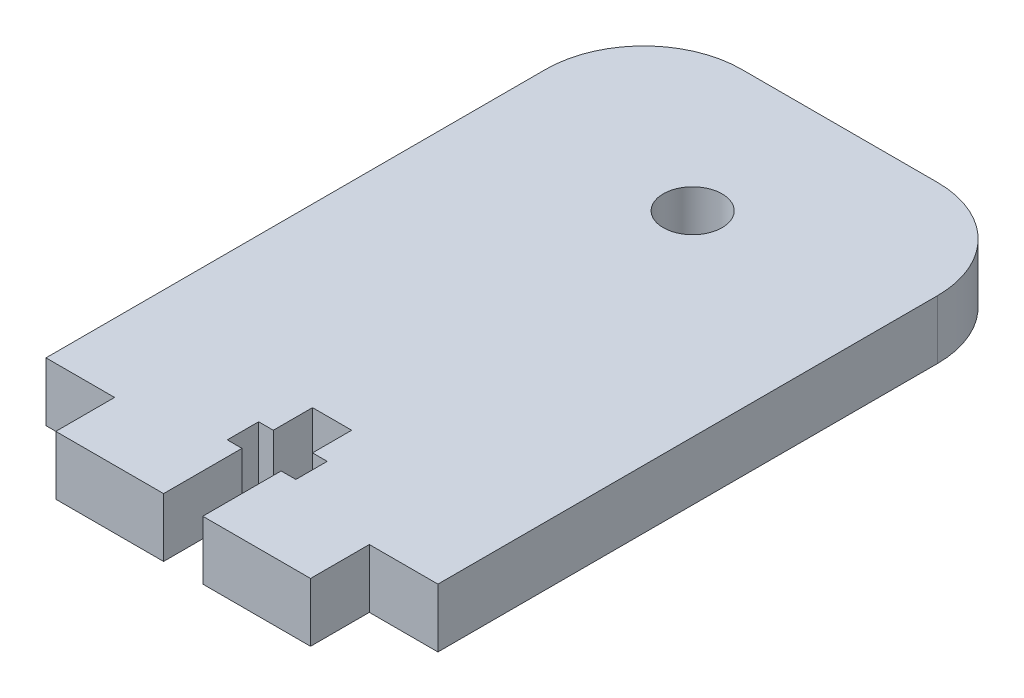
ISO-10303-21;
HEADER;
FILE_DESCRIPTION(('STEP AP214'),'2;1');
FILE_NAME('part.step','',(''),(''),'','','');
FILE_SCHEMA(('AUTOMOTIVE_DESIGN { 1 0 10303 214 1 1 1 1 }'));
ENDSEC;
DATA;
#1=APPLICATION_CONTEXT('core data for automotive mechanical design processes');
#2=APPLICATION_PROTOCOL_DEFINITION('international standard','automotive_design',2000,#1);
#3=PRODUCT_CONTEXT('',#1,'mechanical');
#4=PRODUCT('Part','Part','',(#3));
#5=PRODUCT_RELATED_PRODUCT_CATEGORY('part','',(#4));
#6=PRODUCT_DEFINITION_FORMATION('','',#4);
#7=PRODUCT_DEFINITION_CONTEXT('part definition',#1,'design');
#8=PRODUCT_DEFINITION('design','',#6,#7);
#9=PRODUCT_DEFINITION_SHAPE('','',#8);
#10=(LENGTH_UNIT() NAMED_UNIT(*) SI_UNIT(.MILLI.,.METRE.));
#11=(NAMED_UNIT(*) PLANE_ANGLE_UNIT() SI_UNIT($,.RADIAN.));
#12=(NAMED_UNIT(*) SI_UNIT($,.STERADIAN.) SOLID_ANGLE_UNIT());
#13=UNCERTAINTY_MEASURE_WITH_UNIT(LENGTH_MEASURE(1.E-05),#10,'distance_accuracy_value','');
#14=(GEOMETRIC_REPRESENTATION_CONTEXT(3) GLOBAL_UNCERTAINTY_ASSIGNED_CONTEXT((#13)) GLOBAL_UNIT_ASSIGNED_CONTEXT((#10,
#11,#12)) REPRESENTATION_CONTEXT('',''));
#15=CARTESIAN_POINT('',(0.,0.,0.));
#16=DIRECTION('',(0.,0.,1.));
#17=DIRECTION('',(1.,0.,0.));
#18=AXIS2_PLACEMENT_3D('',#15,#16,#17);
#19=CARTESIAN_POINT('',(10.2382336935266,6.,-24.4529347741064));
#20=DIRECTION('',(0.,-1.,0.));
#21=DIRECTION('',(0.,0.,-1.));
#22=AXIS2_PLACEMENT_3D('',#19,#20,#21);
#23=PLANE('',#22);
#24=DIRECTION('',(1.,0.,0.));
#25=VECTOR('',#24,1.);
#26=CARTESIAN_POINT('',(-3.2617663064734,6.,21.3470652258936));
#27=LINE('',#26,#25);
#28=CARTESIAN_POINT('',(-3.2617663064734,6.,21.3470652258936));
#29=VERTEX_POINT('',#28);
#30=CARTESIAN_POINT('',(-1.7617663064734,6.,21.3470652258936));
#31=VERTEX_POINT('',#30);
#32=EDGE_CURVE('E293',#29,#31,#27,.T.);
#33=ORIENTED_EDGE('',*,*,#32,.T.);
#34=DIRECTION('',(0.,0.,-1.));
#35=VECTOR('',#34,1.);
#36=CARTESIAN_POINT('',(-1.7617663064734,6.,21.3470652258936));
#37=LINE('',#36,#35);
#38=CARTESIAN_POINT('',(-1.7617663064734,6.,17.3470652258936));
#39=VERTEX_POINT('',#38);
#40=EDGE_CURVE('E145',#31,#39,#37,.T.);
#41=ORIENTED_EDGE('',*,*,#40,.T.);
#42=DIRECTION('',(1.,0.,0.));
#43=VECTOR('',#42,1.);
#44=CARTESIAN_POINT('',(-1.7617663064734,6.,17.3470652258936));
#45=LINE('',#44,#43);
#46=CARTESIAN_POINT('',(2.2382336935266,6.,17.3470652258936));
#47=VERTEX_POINT('',#46);
#48=EDGE_CURVE('E370',#39,#47,#45,.T.);
#49=ORIENTED_EDGE('',*,*,#48,.T.);
#50=DIRECTION('',(0.,0.,1.));
#51=VECTOR('',#50,1.);
#52=CARTESIAN_POINT('',(2.2382336935266,6.,17.3470652258936));
#53=LINE('',#52,#51);
#54=CARTESIAN_POINT('',(2.2382336935266,6.,21.3470652258936));
#55=VERTEX_POINT('',#54);
#56=EDGE_CURVE('E390',#47,#55,#53,.T.);
#57=ORIENTED_EDGE('',*,*,#56,.T.);
#58=DIRECTION('',(1.,0.,0.));
#59=VECTOR('',#58,1.);
#60=CARTESIAN_POINT('',(2.2382336935266,6.,21.3470652258936));
#61=LINE('',#60,#59);
#62=CARTESIAN_POINT('',(3.7382336935266,6.,21.3470652258936));
#63=VERTEX_POINT('',#62);
#64=EDGE_CURVE('E386',#55,#63,#61,.T.);
#65=ORIENTED_EDGE('',*,*,#64,.T.);
#66=DIRECTION('',(0.,0.,1.));
#67=VECTOR('',#66,1.);
#68=CARTESIAN_POINT('',(3.7382336935266,6.,21.3470652258936));
#69=LINE('',#68,#67);
#70=CARTESIAN_POINT('',(3.7382336935266,6.,24.5470652258936));
#71=VERTEX_POINT('',#70);
#72=EDGE_CURVE('E389',#63,#71,#69,.T.);
#73=ORIENTED_EDGE('',*,*,#72,.T.);
#74=DIRECTION('',(-1.,0.,0.));
#75=VECTOR('',#74,1.);
#76=CARTESIAN_POINT('',(3.7382336935266,6.,24.5470652258936));
#77=LINE('',#76,#75);
#78=CARTESIAN_POINT('',(2.2382336935266,6.,24.5470652258936));
#79=VERTEX_POINT('',#78);
#80=EDGE_CURVE('E394',#71,#79,#77,.T.);
#81=ORIENTED_EDGE('',*,*,#80,.T.);
#82=DIRECTION('',(0.,0.,1.));
#83=VECTOR('',#82,1.);
#84=CARTESIAN_POINT('',(2.2382336935266,6.,24.5470652258936));
#85=LINE('',#84,#83);
#86=CARTESIAN_POINT('',(2.2382336935266,6.,32.5470652258936));
#87=VERTEX_POINT('',#86);
#88=EDGE_CURVE('E401',#79,#87,#85,.T.);
#89=ORIENTED_EDGE('',*,*,#88,.T.);
#90=DIRECTION('',(1.,0.,0.));
#91=VECTOR('',#90,1.);
#92=CARTESIAN_POINT('',(2.2382336935266,6.,32.5470652258936));
#93=LINE('',#92,#91);
#94=CARTESIAN_POINT('',(13.2382336935266,6.,32.5470652258936));
#95=VERTEX_POINT('',#94);
#96=EDGE_CURVE('E404',#87,#95,#93,.T.);
#97=ORIENTED_EDGE('',*,*,#96,.T.);
#98=DIRECTION('',(0.,0.,-1.));
#99=VECTOR('',#98,1.);
#100=CARTESIAN_POINT('',(13.2382336935266,6.,26.5470652258936));
#101=LINE('',#100,#99);
#102=CARTESIAN_POINT('',(13.2382336935266,6.,26.5470652258936));
#103=VERTEX_POINT('',#102);
#104=EDGE_CURVE('E407',#95,#103,#101,.T.);
#105=ORIENTED_EDGE('',*,*,#104,.T.);
#106=DIRECTION('',(1.,0.,0.));
#107=VECTOR('',#106,1.);
#108=CARTESIAN_POINT('',(13.2382336935266,6.,26.5470652258936));
#109=LINE('',#108,#107);
#110=CARTESIAN_POINT('',(20.2382336935266,6.,26.5470652258936));
#111=VERTEX_POINT('',#110);
#112=EDGE_CURVE('E410',#103,#111,#109,.T.);
#113=ORIENTED_EDGE('',*,*,#112,.T.);
#114=DIRECTION('',(0.,0.,-1.));
#115=VECTOR('',#114,1.);
#116=CARTESIAN_POINT('',(20.2382336935266,6.,-24.4529347741064));
#117=LINE('',#116,#115);
#118=CARTESIAN_POINT('',(20.2382336935266,6.,-24.4529347741064));
#119=VERTEX_POINT('',#118);
#120=EDGE_CURVE('E413',#111,#119,#117,.T.);
#121=ORIENTED_EDGE('',*,*,#120,.T.);
#122=CARTESIAN_POINT('',(10.2382336935266,6.,-24.4529347741064));
#123=DIRECTION('',(0.,1.,0.));
#124=DIRECTION('',(0.,0.,-1.));
#125=AXIS2_PLACEMENT_3D('',#122,#123,#124);
#126=CIRCLE('',#125,10.);
#127=CARTESIAN_POINT('',(10.2382336935266,6.,-34.4529347741064));
#128=VERTEX_POINT('',#127);
#129=EDGE_CURVE('E416',#119,#128,#126,.T.);
#130=ORIENTED_EDGE('',*,*,#129,.T.);
#131=DIRECTION('',(-1.,0.,0.));
#132=VECTOR('',#131,1.);
#133=CARTESIAN_POINT('',(-9.7617663064734,6.,-34.4529347741064));
#134=LINE('',#133,#132);
#135=CARTESIAN_POINT('',(-9.7617663064734,6.,-34.4529347741064));
#136=VERTEX_POINT('',#135);
#137=EDGE_CURVE('E419',#128,#136,#134,.T.);
#138=ORIENTED_EDGE('',*,*,#137,.T.);
#139=CARTESIAN_POINT('',(-9.7617663064734,6.,-24.4529347741064));
#140=DIRECTION('',(0.,1.,0.));
#141=DIRECTION('',(0.,0.,1.));
#142=AXIS2_PLACEMENT_3D('',#139,#140,#141);
#143=CIRCLE('',#142,10.);
#144=CARTESIAN_POINT('',(-19.7617663064734,6.,-24.4529347741064));
#145=VERTEX_POINT('',#144);
#146=EDGE_CURVE('E422',#136,#145,#143,.T.);
#147=ORIENTED_EDGE('',*,*,#146,.T.);
#148=DIRECTION('',(0.,0.,1.));
#149=VECTOR('',#148,1.);
#150=CARTESIAN_POINT('',(-19.7617663064734,6.,-24.4529347741064));
#151=LINE('',#150,#149);
#152=CARTESIAN_POINT('',(-19.7617663064734,6.,26.5470652258936));
#153=VERTEX_POINT('',#152);
#154=EDGE_CURVE('E425',#145,#153,#151,.T.);
#155=ORIENTED_EDGE('',*,*,#154,.T.);
#156=DIRECTION('',(1.,0.,0.));
#157=VECTOR('',#156,1.);
#158=CARTESIAN_POINT('',(-12.7617663064734,6.,26.5470652258936));
#159=LINE('',#158,#157);
#160=CARTESIAN_POINT('',(-12.7617663064734,6.,26.5470652258936));
#161=VERTEX_POINT('',#160);
#162=EDGE_CURVE('E428',#153,#161,#159,.T.);
#163=ORIENTED_EDGE('',*,*,#162,.T.);
#164=DIRECTION('',(0.,0.,1.));
#165=VECTOR('',#164,1.);
#166=CARTESIAN_POINT('',(-12.7617663064734,6.,26.5470652258936));
#167=LINE('',#166,#165);
#168=CARTESIAN_POINT('',(-12.7617663064734,6.,32.5470652258936));
#169=VERTEX_POINT('',#168);
#170=EDGE_CURVE('E431',#161,#169,#167,.T.);
#171=ORIENTED_EDGE('',*,*,#170,.T.);
#172=DIRECTION('',(1.,0.,0.));
#173=VECTOR('',#172,1.);
#174=CARTESIAN_POINT('',(-12.7617663064734,6.,32.5470652258936));
#175=LINE('',#174,#173);
#176=CARTESIAN_POINT('',(-1.7617663064734,6.,32.5470652258936));
#177=VERTEX_POINT('',#176);
#178=EDGE_CURVE('E206',#169,#177,#175,.T.);
#179=ORIENTED_EDGE('',*,*,#178,.T.);
#180=DIRECTION('',(0.,0.,-1.));
#181=VECTOR('',#180,1.);
#182=CARTESIAN_POINT('',(-1.7617663064734,6.,32.5470652258936));
#183=LINE('',#182,#181);
#184=CARTESIAN_POINT('',(-1.7617663064734,6.,24.5470652258936));
#185=VERTEX_POINT('',#184);
#186=EDGE_CURVE('E200',#177,#185,#183,.T.);
#187=ORIENTED_EDGE('',*,*,#186,.T.);
#188=DIRECTION('',(-1.,0.,0.));
#189=VECTOR('',#188,1.);
#190=CARTESIAN_POINT('',(-1.7617663064734,6.,24.5470652258936));
#191=LINE('',#190,#189);
#192=CARTESIAN_POINT('',(-3.2617663064734,6.,24.5470652258936));
#193=VERTEX_POINT('',#192);
#194=EDGE_CURVE('E204',#185,#193,#191,.T.);
#195=ORIENTED_EDGE('',*,*,#194,.T.);
#196=DIRECTION('',(0.,0.,-1.));
#197=VECTOR('',#196,1.);
#198=CARTESIAN_POINT('',(-3.2617663064734,6.,24.5470652258936));
#199=LINE('',#198,#197);
#200=EDGE_CURVE('E60',#193,#29,#199,.T.);
#201=ORIENTED_EDGE('',*,*,#200,.T.);
#202=EDGE_LOOP('',(#33,#41,#49,#57,#65,#73,#81,#89,#97,#105,#113,#121,#130,#138,#147,#155,#163,
#171,#179,#187,#195,#201));
#203=FACE_BOUND('',#202,.T.);
#204=CARTESIAN_POINT('',(0.2382336935266,6.,-19.4529347741064));
#205=DIRECTION('',(0.,1.,0.));
#206=DIRECTION('',(0.,0.,1.));
#207=AXIS2_PLACEMENT_3D('',#204,#205,#206);
#208=CIRCLE('',#207,3.);
#209=CARTESIAN_POINT('',(0.2382336935266,6.,-16.4529347741064));
#210=VERTEX_POINT('',#209);
#211=EDGE_CURVE('E233',#210,#210,#208,.T.);
#212=ORIENTED_EDGE('',*,*,#211,.F.);
#213=EDGE_LOOP('',(#212));
#214=FACE_BOUND('',#213,.T.);
#215=ADVANCED_FACE('F42',(#203,#214),#23,.F.);
#216=CARTESIAN_POINT('',(10.2382336935266,0.,-24.4529347741064));
#217=DIRECTION('',(0.,-1.,0.));
#218=DIRECTION('',(0.,0.,-1.));
#219=AXIS2_PLACEMENT_3D('',#216,#217,#218);
#220=PLANE('',#219);
#221=DIRECTION('',(1.,0.,0.));
#222=VECTOR('',#221,1.);
#223=CARTESIAN_POINT('',(-3.2617663064734,0.,21.3470652258936));
#224=LINE('',#223,#222);
#225=CARTESIAN_POINT('',(-3.2617663064734,0.,21.3470652258936));
#226=VERTEX_POINT('',#225);
#227=CARTESIAN_POINT('',(-1.7617663064734,0.,21.3470652258936));
#228=VERTEX_POINT('',#227);
#229=EDGE_CURVE('E228',#226,#228,#224,.T.);
#230=ORIENTED_EDGE('',*,*,#229,.F.);
#231=DIRECTION('',(0.,0.,-1.));
#232=VECTOR('',#231,1.);
#233=CARTESIAN_POINT('',(-3.2617663064734,0.,24.5470652258936));
#234=LINE('',#233,#232);
#235=CARTESIAN_POINT('',(-3.2617663064734,0.,24.5470652258936));
#236=VERTEX_POINT('',#235);
#237=EDGE_CURVE('E137',#236,#226,#234,.T.);
#238=ORIENTED_EDGE('',*,*,#237,.F.);
#239=DIRECTION('',(-1.,0.,0.));
#240=VECTOR('',#239,1.);
#241=CARTESIAN_POINT('',(-1.7617663064734,0.,24.5470652258936));
#242=LINE('',#241,#240);
#243=CARTESIAN_POINT('',(-1.7617663064734,0.,24.5470652258936));
#244=VERTEX_POINT('',#243);
#245=EDGE_CURVE('E131',#244,#236,#242,.T.);
#246=ORIENTED_EDGE('',*,*,#245,.F.);
#247=DIRECTION('',(0.,0.,-1.));
#248=VECTOR('',#247,1.);
#249=CARTESIAN_POINT('',(-1.7617663064734,0.,32.5470652258936));
#250=LINE('',#249,#248);
#251=CARTESIAN_POINT('',(-1.7617663064734,0.,32.5470652258936));
#252=VERTEX_POINT('',#251);
#253=EDGE_CURVE('E215',#252,#244,#250,.T.);
#254=ORIENTED_EDGE('',*,*,#253,.F.);
#255=DIRECTION('',(1.,0.,0.));
#256=VECTOR('',#255,1.);
#257=CARTESIAN_POINT('',(-12.7617663064734,0.,32.5470652258936));
#258=LINE('',#257,#256);
#259=CARTESIAN_POINT('',(-12.7617663064734,0.,32.5470652258936));
#260=VERTEX_POINT('',#259);
#261=EDGE_CURVE('E284',#260,#252,#258,.T.);
#262=ORIENTED_EDGE('',*,*,#261,.F.);
#263=DIRECTION('',(0.,0.,1.));
#264=VECTOR('',#263,1.);
#265=CARTESIAN_POINT('',(-12.7617663064734,0.,26.5470652258936));
#266=LINE('',#265,#264);
#267=CARTESIAN_POINT('',(-12.7617663064734,0.,26.5470652258936));
#268=VERTEX_POINT('',#267);
#269=EDGE_CURVE('E281',#268,#260,#266,.T.);
#270=ORIENTED_EDGE('',*,*,#269,.F.);
#271=DIRECTION('',(1.,0.,0.));
#272=VECTOR('',#271,1.);
#273=CARTESIAN_POINT('',(-12.7617663064734,0.,26.5470652258936));
#274=LINE('',#273,#272);
#275=CARTESIAN_POINT('',(-19.7617663064734,0.,26.5470652258936));
#276=VERTEX_POINT('',#275);
#277=EDGE_CURVE('E278',#276,#268,#274,.T.);
#278=ORIENTED_EDGE('',*,*,#277,.F.);
#279=DIRECTION('',(0.,0.,1.));
#280=VECTOR('',#279,1.);
#281=CARTESIAN_POINT('',(-19.7617663064734,0.,-24.4529347741064));
#282=LINE('',#281,#280);
#283=CARTESIAN_POINT('',(-19.7617663064734,0.,-24.4529347741064));
#284=VERTEX_POINT('',#283);
#285=EDGE_CURVE('E275',#284,#276,#282,.T.);
#286=ORIENTED_EDGE('',*,*,#285,.F.);
#287=CARTESIAN_POINT('',(-9.7617663064734,0.,-24.4529347741064));
#288=DIRECTION('',(0.,1.,0.));
#289=DIRECTION('',(0.,0.,1.));
#290=AXIS2_PLACEMENT_3D('',#287,#288,#289);
#291=CIRCLE('',#290,10.);
#292=CARTESIAN_POINT('',(-9.7617663064734,0.,-34.4529347741064));
#293=VERTEX_POINT('',#292);
#294=EDGE_CURVE('E272',#293,#284,#291,.T.);
#295=ORIENTED_EDGE('',*,*,#294,.F.);
#296=DIRECTION('',(-1.,0.,0.));
#297=VECTOR('',#296,1.);
#298=CARTESIAN_POINT('',(-9.7617663064734,0.,-34.4529347741064));
#299=LINE('',#298,#297);
#300=CARTESIAN_POINT('',(10.2382336935266,0.,-34.4529347741064));
#301=VERTEX_POINT('',#300);
#302=EDGE_CURVE('E269',#301,#293,#299,.T.);
#303=ORIENTED_EDGE('',*,*,#302,.F.);
#304=CARTESIAN_POINT('',(10.2382336935266,0.,-24.4529347741064));
#305=DIRECTION('',(0.,1.,0.));
#306=DIRECTION('',(0.,0.,-1.));
#307=AXIS2_PLACEMENT_3D('',#304,#305,#306);
#308=CIRCLE('',#307,10.);
#309=CARTESIAN_POINT('',(20.2382336935266,0.,-24.4529347741064));
#310=VERTEX_POINT('',#309);
#311=EDGE_CURVE('E266',#310,#301,#308,.T.);
#312=ORIENTED_EDGE('',*,*,#311,.F.);
#313=DIRECTION('',(0.,0.,-1.));
#314=VECTOR('',#313,1.);
#315=CARTESIAN_POINT('',(20.2382336935266,0.,-24.4529347741064));
#316=LINE('',#315,#314);
#317=CARTESIAN_POINT('',(20.2382336935266,0.,26.5470652258936));
#318=VERTEX_POINT('',#317);
#319=EDGE_CURVE('E263',#318,#310,#316,.T.);
#320=ORIENTED_EDGE('',*,*,#319,.F.);
#321=DIRECTION('',(1.,0.,0.));
#322=VECTOR('',#321,1.);
#323=CARTESIAN_POINT('',(13.2382336935266,0.,26.5470652258936));
#324=LINE('',#323,#322);
#325=CARTESIAN_POINT('',(13.2382336935266,0.,26.5470652258936));
#326=VERTEX_POINT('',#325);
#327=EDGE_CURVE('E260',#326,#318,#324,.T.);
#328=ORIENTED_EDGE('',*,*,#327,.F.);
#329=DIRECTION('',(0.,0.,-1.));
#330=VECTOR('',#329,1.);
#331=CARTESIAN_POINT('',(13.2382336935266,0.,26.5470652258936));
#332=LINE('',#331,#330);
#333=CARTESIAN_POINT('',(13.2382336935266,0.,32.5470652258936));
#334=VERTEX_POINT('',#333);
#335=EDGE_CURVE('E257',#334,#326,#332,.T.);
#336=ORIENTED_EDGE('',*,*,#335,.F.);
#337=DIRECTION('',(1.,0.,0.));
#338=VECTOR('',#337,1.);
#339=CARTESIAN_POINT('',(2.2382336935266,0.,32.5470652258936));
#340=LINE('',#339,#338);
#341=CARTESIAN_POINT('',(2.2382336935266,0.,32.5470652258936));
#342=VERTEX_POINT('',#341);
#343=EDGE_CURVE('E254',#342,#334,#340,.T.);
#344=ORIENTED_EDGE('',*,*,#343,.F.);
#345=DIRECTION('',(0.,0.,1.));
#346=VECTOR('',#345,1.);
#347=CARTESIAN_POINT('',(2.2382336935266,0.,24.5470652258936));
#348=LINE('',#347,#346);
#349=CARTESIAN_POINT('',(2.2382336935266,0.,24.5470652258936));
#350=VERTEX_POINT('',#349);
#351=EDGE_CURVE('E251',#350,#342,#348,.T.);
#352=ORIENTED_EDGE('',*,*,#351,.F.);
#353=DIRECTION('',(-1.,0.,0.));
#354=VECTOR('',#353,1.);
#355=CARTESIAN_POINT('',(3.7382336935266,0.,24.5470652258936));
#356=LINE('',#355,#354);
#357=CARTESIAN_POINT('',(3.7382336935266,0.,24.5470652258936));
#358=VERTEX_POINT('',#357);
#359=EDGE_CURVE('E248',#358,#350,#356,.T.);
#360=ORIENTED_EDGE('',*,*,#359,.F.);
#361=DIRECTION('',(0.,0.,1.));
#362=VECTOR('',#361,1.);
#363=CARTESIAN_POINT('',(3.7382336935266,0.,21.3470652258936));
#364=LINE('',#363,#362);
#365=CARTESIAN_POINT('',(3.7382336935266,0.,21.3470652258936));
#366=VERTEX_POINT('',#365);
#367=EDGE_CURVE('E245',#366,#358,#364,.T.);
#368=ORIENTED_EDGE('',*,*,#367,.F.);
#369=DIRECTION('',(1.,0.,0.));
#370=VECTOR('',#369,1.);
#371=CARTESIAN_POINT('',(2.2382336935266,0.,21.3470652258936));
#372=LINE('',#371,#370);
#373=CARTESIAN_POINT('',(2.2382336935266,0.,21.3470652258936));
#374=VERTEX_POINT('',#373);
#375=EDGE_CURVE('E242',#374,#366,#372,.T.);
#376=ORIENTED_EDGE('',*,*,#375,.F.);
#377=DIRECTION('',(0.,0.,1.));
#378=VECTOR('',#377,1.);
#379=CARTESIAN_POINT('',(2.2382336935266,0.,17.3470652258936));
#380=LINE('',#379,#378);
#381=CARTESIAN_POINT('',(2.2382336935266,0.,17.3470652258936));
#382=VERTEX_POINT('',#381);
#383=EDGE_CURVE('E239',#382,#374,#380,.T.);
#384=ORIENTED_EDGE('',*,*,#383,.F.);
#385=DIRECTION('',(1.,0.,0.));
#386=VECTOR('',#385,1.);
#387=CARTESIAN_POINT('',(-1.7617663064734,0.,17.3470652258936));
#388=LINE('',#387,#386);
#389=CARTESIAN_POINT('',(-1.7617663064734,0.,17.3470652258936));
#390=VERTEX_POINT('',#389);
#391=EDGE_CURVE('E236',#390,#382,#388,.T.);
#392=ORIENTED_EDGE('',*,*,#391,.F.);
#393=DIRECTION('',(0.,0.,-1.));
#394=VECTOR('',#393,1.);
#395=CARTESIAN_POINT('',(-1.7617663064734,0.,21.3470652258936));
#396=LINE('',#395,#394);
#397=EDGE_CURVE('E232',#228,#390,#396,.T.);
#398=ORIENTED_EDGE('',*,*,#397,.F.);
#399=EDGE_LOOP('',(#230,#238,#246,#254,#262,#270,#278,#286,#295,#303,#312,#320,#328,#336,#344,
#352,#360,#368,#376,#384,#392,#398));
#400=FACE_BOUND('',#399,.T.);
#401=CARTESIAN_POINT('',(0.2382336935266,0.,-19.4529347741064));
#402=DIRECTION('',(0.,1.,0.));
#403=DIRECTION('',(0.,0.,1.));
#404=AXIS2_PLACEMENT_3D('',#401,#402,#403);
#405=CIRCLE('',#404,3.);
#406=CARTESIAN_POINT('',(0.2382336935266,0.,-16.4529347741064));
#407=VERTEX_POINT('',#406);
#408=EDGE_CURVE('E760',#407,#407,#405,.T.);
#409=ORIENTED_EDGE('',*,*,#408,.T.);
#410=EDGE_LOOP('',(#409));
#411=FACE_BOUND('',#410,.T.);
#412=ADVANCED_FACE('F374',(#400,#411),#220,.T.);
#413=CARTESIAN_POINT('',(-3.2617663064734,6.,21.3470652258936));
#414=DIRECTION('',(0.,0.,-1.));
#415=DIRECTION('',(-1.,0.,0.));
#416=AXIS2_PLACEMENT_3D('',#413,#414,#415);
#417=PLANE('',#416);
#418=ORIENTED_EDGE('',*,*,#229,.T.);
#419=DIRECTION('',(0.,-1.,0.));
#420=VECTOR('',#419,1.);
#421=CARTESIAN_POINT('',(-1.7617663064734,6.,21.3470652258936));
#422=LINE('',#421,#420);
#423=EDGE_CURVE('E11',#31,#228,#422,.T.);
#424=ORIENTED_EDGE('',*,*,#423,.F.);
#425=ORIENTED_EDGE('',*,*,#32,.F.);
#426=DIRECTION('',(0.,-1.,0.));
#427=VECTOR('',#426,1.);
#428=CARTESIAN_POINT('',(-3.2617663064734,6.,21.3470652258936));
#429=LINE('',#428,#427);
#430=EDGE_CURVE('E224',#29,#226,#429,.T.);
#431=ORIENTED_EDGE('',*,*,#430,.T.);
#432=EDGE_LOOP('',(#418,#424,#425,#431));
#433=FACE_BOUND('',#432,.T.);
#434=ADVANCED_FACE('F44',(#433),#417,.F.);
#435=CARTESIAN_POINT('',(-1.7617663064734,6.,21.3470652258936));
#436=DIRECTION('',(-1.,0.,0.));
#437=DIRECTION('',(0.,0.,1.));
#438=AXIS2_PLACEMENT_3D('',#435,#436,#437);
#439=PLANE('',#438);
#440=ORIENTED_EDGE('',*,*,#397,.T.);
#441=DIRECTION('',(0.,-1.,0.));
#442=VECTOR('',#441,1.);
#443=CARTESIAN_POINT('',(-1.7617663064734,6.,17.3470652258936));
#444=LINE('',#443,#442);
#445=EDGE_CURVE('E52',#39,#390,#444,.T.);
#446=ORIENTED_EDGE('',*,*,#445,.F.);
#447=ORIENTED_EDGE('',*,*,#40,.F.);
#448=ORIENTED_EDGE('',*,*,#423,.T.);
#449=EDGE_LOOP('',(#440,#446,#447,#448));
#450=FACE_BOUND('',#449,.T.);
#451=ADVANCED_FACE('F467',(#450),#439,.F.);
#452=CARTESIAN_POINT('',(-1.7617663064734,6.,17.3470652258936));
#453=DIRECTION('',(0.,0.,-1.));
#454=DIRECTION('',(-1.,0.,0.));
#455=AXIS2_PLACEMENT_3D('',#452,#453,#454);
#456=PLANE('',#455);
#457=ORIENTED_EDGE('',*,*,#391,.T.);
#458=DIRECTION('',(0.,-1.,0.));
#459=VECTOR('',#458,1.);
#460=CARTESIAN_POINT('',(2.2382336935266,6.,17.3470652258936));
#461=LINE('',#460,#459);
#462=EDGE_CURVE('E360',#47,#382,#461,.T.);
#463=ORIENTED_EDGE('',*,*,#462,.F.);
#464=ORIENTED_EDGE('',*,*,#48,.F.);
#465=ORIENTED_EDGE('',*,*,#445,.T.);
#466=EDGE_LOOP('',(#457,#463,#464,#465));
#467=FACE_BOUND('',#466,.T.);
#468=ADVANCED_FACE('F368',(#467),#456,.F.);
#469=CARTESIAN_POINT('',(2.2382336935266,6.,17.3470652258936));
#470=DIRECTION('',(1.,0.,0.));
#471=DIRECTION('',(0.,0.,-1.));
#472=AXIS2_PLACEMENT_3D('',#469,#470,#471);
#473=PLANE('',#472);
#474=ORIENTED_EDGE('',*,*,#383,.T.);
#475=DIRECTION('',(0.,-1.,0.));
#476=VECTOR('',#475,1.);
#477=CARTESIAN_POINT('',(2.2382336935266,6.,21.3470652258936));
#478=LINE('',#477,#476);
#479=EDGE_CURVE('E356',#55,#374,#478,.T.);
#480=ORIENTED_EDGE('',*,*,#479,.F.);
#481=ORIENTED_EDGE('',*,*,#56,.F.);
#482=ORIENTED_EDGE('',*,*,#462,.T.);
#483=EDGE_LOOP('',(#474,#480,#481,#482));
#484=FACE_BOUND('',#483,.T.);
#485=ADVANCED_FACE('F380',(#484),#473,.F.);
#486=CARTESIAN_POINT('',(2.2382336935266,6.,21.3470652258936));
#487=DIRECTION('',(0.,0.,-1.));
#488=DIRECTION('',(-1.,0.,0.));
#489=AXIS2_PLACEMENT_3D('',#486,#487,#488);
#490=PLANE('',#489);
#491=ORIENTED_EDGE('',*,*,#375,.T.);
#492=DIRECTION('',(0.,-1.,0.));
#493=VECTOR('',#492,1.);
#494=CARTESIAN_POINT('',(3.7382336935266,6.,21.3470652258936));
#495=LINE('',#494,#493);
#496=EDGE_CURVE('E352',#63,#366,#495,.T.);
#497=ORIENTED_EDGE('',*,*,#496,.F.);
#498=ORIENTED_EDGE('',*,*,#64,.F.);
#499=ORIENTED_EDGE('',*,*,#479,.T.);
#500=EDGE_LOOP('',(#491,#497,#498,#499));
#501=FACE_BOUND('',#500,.T.);
#502=ADVANCED_FACE('F384',(#501),#490,.F.);
#503=CARTESIAN_POINT('',(3.7382336935266,6.,21.3470652258936));
#504=DIRECTION('',(1.,0.,0.));
#505=DIRECTION('',(0.,0.,-1.));
#506=AXIS2_PLACEMENT_3D('',#503,#504,#505);
#507=PLANE('',#506);
#508=ORIENTED_EDGE('',*,*,#367,.T.);
#509=DIRECTION('',(0.,-1.,0.));
#510=VECTOR('',#509,1.);
#511=CARTESIAN_POINT('',(3.7382336935266,6.,24.5470652258936));
#512=LINE('',#511,#510);
#513=EDGE_CURVE('E348',#71,#358,#512,.T.);
#514=ORIENTED_EDGE('',*,*,#513,.F.);
#515=ORIENTED_EDGE('',*,*,#72,.F.);
#516=ORIENTED_EDGE('',*,*,#496,.T.);
#517=EDGE_LOOP('',(#508,#514,#515,#516));
#518=FACE_BOUND('',#517,.T.);
#519=ADVANCED_FACE('F480',(#518),#507,.F.);
#520=CARTESIAN_POINT('',(3.7382336935266,6.,24.5470652258936));
#521=DIRECTION('',(0.,0.,1.));
#522=DIRECTION('',(1.,0.,0.));
#523=AXIS2_PLACEMENT_3D('',#520,#521,#522);
#524=PLANE('',#523);
#525=ORIENTED_EDGE('',*,*,#359,.T.);
#526=DIRECTION('',(0.,-1.,0.));
#527=VECTOR('',#526,1.);
#528=CARTESIAN_POINT('',(2.2382336935266,6.,24.5470652258936));
#529=LINE('',#528,#527);
#530=EDGE_CURVE('E344',#79,#350,#529,.T.);
#531=ORIENTED_EDGE('',*,*,#530,.F.);
#532=ORIENTED_EDGE('',*,*,#80,.F.);
#533=ORIENTED_EDGE('',*,*,#513,.T.);
#534=EDGE_LOOP('',(#525,#531,#532,#533));
#535=FACE_BOUND('',#534,.T.);
#536=ADVANCED_FACE('F483',(#535),#524,.F.);
#537=CARTESIAN_POINT('',(2.2382336935266,6.,24.5470652258936));
#538=DIRECTION('',(1.,0.,0.));
#539=DIRECTION('',(0.,0.,-1.));
#540=AXIS2_PLACEMENT_3D('',#537,#538,#539);
#541=PLANE('',#540);
#542=ORIENTED_EDGE('',*,*,#351,.T.);
#543=DIRECTION('',(0.,-1.,0.));
#544=VECTOR('',#543,1.);
#545=CARTESIAN_POINT('',(2.2382336935266,6.,32.5470652258936));
#546=LINE('',#545,#544);
#547=EDGE_CURVE('E340',#87,#342,#546,.T.);
#548=ORIENTED_EDGE('',*,*,#547,.F.);
#549=ORIENTED_EDGE('',*,*,#88,.F.);
#550=ORIENTED_EDGE('',*,*,#530,.T.);
#551=EDGE_LOOP('',(#542,#548,#549,#550));
#552=FACE_BOUND('',#551,.T.);
#553=ADVANCED_FACE('F487',(#552),#541,.F.);
#554=CARTESIAN_POINT('',(2.2382336935266,6.,32.5470652258936));
#555=DIRECTION('',(0.,0.,-1.));
#556=DIRECTION('',(-1.,0.,0.));
#557=AXIS2_PLACEMENT_3D('',#554,#555,#556);
#558=PLANE('',#557);
#559=ORIENTED_EDGE('',*,*,#343,.T.);
#560=DIRECTION('',(0.,-1.,0.));
#561=VECTOR('',#560,1.);
#562=CARTESIAN_POINT('',(13.2382336935266,6.,32.5470652258936));
#563=LINE('',#562,#561);
#564=EDGE_CURVE('E336',#95,#334,#563,.T.);
#565=ORIENTED_EDGE('',*,*,#564,.F.);
#566=ORIENTED_EDGE('',*,*,#96,.F.);
#567=ORIENTED_EDGE('',*,*,#547,.T.);
#568=EDGE_LOOP('',(#559,#565,#566,#567));
#569=FACE_BOUND('',#568,.T.);
#570=ADVANCED_FACE('F491',(#569),#558,.F.);
#571=CARTESIAN_POINT('',(13.2382336935266,6.,26.5470652258936));
#572=DIRECTION('',(-1.,0.,0.));
#573=DIRECTION('',(0.,0.,1.));
#574=AXIS2_PLACEMENT_3D('',#571,#572,#573);
#575=PLANE('',#574);
#576=ORIENTED_EDGE('',*,*,#335,.T.);
#577=DIRECTION('',(0.,-1.,0.));
#578=VECTOR('',#577,1.);
#579=CARTESIAN_POINT('',(13.2382336935266,6.,26.5470652258936));
#580=LINE('',#579,#578);
#581=EDGE_CURVE('E332',#103,#326,#580,.T.);
#582=ORIENTED_EDGE('',*,*,#581,.F.);
#583=ORIENTED_EDGE('',*,*,#104,.F.);
#584=ORIENTED_EDGE('',*,*,#564,.T.);
#585=EDGE_LOOP('',(#576,#582,#583,#584));
#586=FACE_BOUND('',#585,.T.);
#587=ADVANCED_FACE('F495',(#586),#575,.F.);
#588=CARTESIAN_POINT('',(13.2382336935266,6.,26.5470652258936));
#589=DIRECTION('',(0.,0.,-1.));
#590=DIRECTION('',(-1.,0.,0.));
#591=AXIS2_PLACEMENT_3D('',#588,#589,#590);
#592=PLANE('',#591);
#593=ORIENTED_EDGE('',*,*,#327,.T.);
#594=DIRECTION('',(0.,-1.,0.));
#595=VECTOR('',#594,1.);
#596=CARTESIAN_POINT('',(20.2382336935266,6.,26.5470652258936));
#597=LINE('',#596,#595);
#598=EDGE_CURVE('E328',#111,#318,#597,.T.);
#599=ORIENTED_EDGE('',*,*,#598,.F.);
#600=ORIENTED_EDGE('',*,*,#112,.F.);
#601=ORIENTED_EDGE('',*,*,#581,.T.);
#602=EDGE_LOOP('',(#593,#599,#600,#601));
#603=FACE_BOUND('',#602,.T.);
#604=ADVANCED_FACE('F499',(#603),#592,.F.);
#605=CARTESIAN_POINT('',(20.2382336935266,6.,-24.4529347741064));
#606=DIRECTION('',(-1.,0.,0.));
#607=DIRECTION('',(0.,0.,1.));
#608=AXIS2_PLACEMENT_3D('',#605,#606,#607);
#609=PLANE('',#608);
#610=ORIENTED_EDGE('',*,*,#319,.T.);
#611=DIRECTION('',(0.,-1.,0.));
#612=VECTOR('',#611,1.);
#613=CARTESIAN_POINT('',(20.2382336935266,6.,-24.4529347741064));
#614=LINE('',#613,#612);
#615=EDGE_CURVE('E324',#119,#310,#614,.T.);
#616=ORIENTED_EDGE('',*,*,#615,.F.);
#617=ORIENTED_EDGE('',*,*,#120,.F.);
#618=ORIENTED_EDGE('',*,*,#598,.T.);
#619=EDGE_LOOP('',(#610,#616,#617,#618));
#620=FACE_BOUND('',#619,.T.);
#621=ADVANCED_FACE('F503',(#620),#609,.F.);
#622=CARTESIAN_POINT('',(10.2382336935266,6.,-24.4529347741064));
#623=DIRECTION('',(0.,-1.,0.));
#624=DIRECTION('',(0.,0.,-1.));
#625=AXIS2_PLACEMENT_3D('',#622,#623,#624);
#626=CYLINDRICAL_SURFACE('',#625,10.);
#627=ORIENTED_EDGE('',*,*,#311,.T.);
#628=DIRECTION('',(0.,-1.,0.));
#629=VECTOR('',#628,1.);
#630=CARTESIAN_POINT('',(10.2382336935266,6.,-34.4529347741064));
#631=LINE('',#630,#629);
#632=EDGE_CURVE('E320',#128,#301,#631,.T.);
#633=ORIENTED_EDGE('',*,*,#632,.F.);
#634=ORIENTED_EDGE('',*,*,#129,.F.);
#635=ORIENTED_EDGE('',*,*,#615,.T.);
#636=EDGE_LOOP('',(#627,#633,#634,#635));
#637=FACE_BOUND('',#636,.T.);
#638=ADVANCED_FACE('F507',(#637),#626,.T.);
#639=CARTESIAN_POINT('',(-9.7617663064734,6.,-34.4529347741064));
#640=DIRECTION('',(0.,0.,1.));
#641=DIRECTION('',(1.,0.,0.));
#642=AXIS2_PLACEMENT_3D('',#639,#640,#641);
#643=PLANE('',#642);
#644=ORIENTED_EDGE('',*,*,#302,.T.);
#645=DIRECTION('',(0.,-1.,0.));
#646=VECTOR('',#645,1.);
#647=CARTESIAN_POINT('',(-9.7617663064734,6.,-34.4529347741064));
#648=LINE('',#647,#646);
#649=EDGE_CURVE('E316',#136,#293,#648,.T.);
#650=ORIENTED_EDGE('',*,*,#649,.F.);
#651=ORIENTED_EDGE('',*,*,#137,.F.);
#652=ORIENTED_EDGE('',*,*,#632,.T.);
#653=EDGE_LOOP('',(#644,#650,#651,#652));
#654=FACE_BOUND('',#653,.T.);
#655=ADVANCED_FACE('F511',(#654),#643,.F.);
#656=CARTESIAN_POINT('',(-9.7617663064734,6.,-24.4529347741064));
#657=DIRECTION('',(0.,-1.,0.));
#658=DIRECTION('',(0.,0.,-1.));
#659=AXIS2_PLACEMENT_3D('',#656,#657,#658);
#660=CYLINDRICAL_SURFACE('',#659,10.);
#661=ORIENTED_EDGE('',*,*,#294,.T.);
#662=DIRECTION('',(0.,-1.,0.));
#663=VECTOR('',#662,1.);
#664=CARTESIAN_POINT('',(-19.7617663064734,6.,-24.4529347741064));
#665=LINE('',#664,#663);
#666=EDGE_CURVE('E312',#145,#284,#665,.T.);
#667=ORIENTED_EDGE('',*,*,#666,.F.);
#668=ORIENTED_EDGE('',*,*,#146,.F.);
#669=ORIENTED_EDGE('',*,*,#649,.T.);
#670=EDGE_LOOP('',(#661,#667,#668,#669));
#671=FACE_BOUND('',#670,.T.);
#672=ADVANCED_FACE('F515',(#671),#660,.T.);
#673=CARTESIAN_POINT('',(-19.7617663064734,6.,-24.4529347741064));
#674=DIRECTION('',(1.,0.,0.));
#675=DIRECTION('',(0.,0.,-1.));
#676=AXIS2_PLACEMENT_3D('',#673,#674,#675);
#677=PLANE('',#676);
#678=ORIENTED_EDGE('',*,*,#285,.T.);
#679=DIRECTION('',(0.,-1.,0.));
#680=VECTOR('',#679,1.);
#681=CARTESIAN_POINT('',(-19.7617663064734,6.,26.5470652258936));
#682=LINE('',#681,#680);
#683=EDGE_CURVE('E308',#153,#276,#682,.T.);
#684=ORIENTED_EDGE('',*,*,#683,.F.);
#685=ORIENTED_EDGE('',*,*,#154,.F.);
#686=ORIENTED_EDGE('',*,*,#666,.T.);
#687=EDGE_LOOP('',(#678,#684,#685,#686));
#688=FACE_BOUND('',#687,.T.);
#689=ADVANCED_FACE('F519',(#688),#677,.F.);
#690=CARTESIAN_POINT('',(-12.7617663064734,6.,26.5470652258936));
#691=DIRECTION('',(0.,0.,-1.));
#692=DIRECTION('',(-1.,0.,0.));
#693=AXIS2_PLACEMENT_3D('',#690,#691,#692);
#694=PLANE('',#693);
#695=ORIENTED_EDGE('',*,*,#277,.T.);
#696=DIRECTION('',(0.,-1.,0.));
#697=VECTOR('',#696,1.);
#698=CARTESIAN_POINT('',(-12.7617663064734,6.,26.5470652258936));
#699=LINE('',#698,#697);
#700=EDGE_CURVE('E304',#161,#268,#699,.T.);
#701=ORIENTED_EDGE('',*,*,#700,.F.);
#702=ORIENTED_EDGE('',*,*,#162,.F.);
#703=ORIENTED_EDGE('',*,*,#683,.T.);
#704=EDGE_LOOP('',(#695,#701,#702,#703));
#705=FACE_BOUND('',#704,.T.);
#706=ADVANCED_FACE('F523',(#705),#694,.F.);
#707=CARTESIAN_POINT('',(-12.7617663064734,6.,26.5470652258936));
#708=DIRECTION('',(1.,0.,0.));
#709=DIRECTION('',(0.,0.,-1.));
#710=AXIS2_PLACEMENT_3D('',#707,#708,#709);
#711=PLANE('',#710);
#712=ORIENTED_EDGE('',*,*,#269,.T.);
#713=DIRECTION('',(0.,-1.,0.));
#714=VECTOR('',#713,1.);
#715=CARTESIAN_POINT('',(-12.7617663064734,6.,32.5470652258936));
#716=LINE('',#715,#714);
#717=EDGE_CURVE('E300',#169,#260,#716,.T.);
#718=ORIENTED_EDGE('',*,*,#717,.F.);
#719=ORIENTED_EDGE('',*,*,#170,.F.);
#720=ORIENTED_EDGE('',*,*,#700,.T.);
#721=EDGE_LOOP('',(#712,#718,#719,#720));
#722=FACE_BOUND('',#721,.T.);
#723=ADVANCED_FACE('F439',(#722),#711,.F.);
#724=CARTESIAN_POINT('',(-12.7617663064734,6.,32.5470652258936));
#725=DIRECTION('',(0.,0.,-1.));
#726=DIRECTION('',(-1.,0.,0.));
#727=AXIS2_PLACEMENT_3D('',#724,#725,#726);
#728=PLANE('',#727);
#729=ORIENTED_EDGE('',*,*,#261,.T.);
#730=DIRECTION('',(0.,-1.,0.));
#731=VECTOR('',#730,1.);
#732=CARTESIAN_POINT('',(-1.7617663064734,6.,32.5470652258936));
#733=LINE('',#732,#731);
#734=EDGE_CURVE('E217',#177,#252,#733,.T.);
#735=ORIENTED_EDGE('',*,*,#734,.F.);
#736=ORIENTED_EDGE('',*,*,#178,.F.);
#737=ORIENTED_EDGE('',*,*,#717,.T.);
#738=EDGE_LOOP('',(#729,#735,#736,#737));
#739=FACE_BOUND('',#738,.T.);
#740=ADVANCED_FACE('F443',(#739),#728,.F.);
#741=CARTESIAN_POINT('',(-1.7617663064734,6.,32.5470652258936));
#742=DIRECTION('',(-1.,0.,0.));
#743=DIRECTION('',(0.,0.,1.));
#744=AXIS2_PLACEMENT_3D('',#741,#742,#743);
#745=PLANE('',#744);
#746=ORIENTED_EDGE('',*,*,#253,.T.);
#747=DIRECTION('',(0.,-1.,0.));
#748=VECTOR('',#747,1.);
#749=CARTESIAN_POINT('',(-1.7617663064734,6.,24.5470652258936));
#750=LINE('',#749,#748);
#751=EDGE_CURVE('E212',#185,#244,#750,.T.);
#752=ORIENTED_EDGE('',*,*,#751,.F.);
#753=ORIENTED_EDGE('',*,*,#186,.F.);
#754=ORIENTED_EDGE('',*,*,#734,.T.);
#755=EDGE_LOOP('',(#746,#752,#753,#754));
#756=FACE_BOUND('',#755,.T.);
#757=ADVANCED_FACE('F213',(#756),#745,.F.);
#758=CARTESIAN_POINT('',(-1.7617663064734,6.,24.5470652258936));
#759=DIRECTION('',(0.,0.,1.));
#760=DIRECTION('',(1.,0.,0.));
#761=AXIS2_PLACEMENT_3D('',#758,#759,#760);
#762=PLANE('',#761);
#763=ORIENTED_EDGE('',*,*,#245,.T.);
#764=DIRECTION('',(0.,-1.,0.));
#765=VECTOR('',#764,1.);
#766=CARTESIAN_POINT('',(-3.2617663064734,6.,24.5470652258936));
#767=LINE('',#766,#765);
#768=EDGE_CURVE('E218',#193,#236,#767,.T.);
#769=ORIENTED_EDGE('',*,*,#768,.F.);
#770=ORIENTED_EDGE('',*,*,#194,.F.);
#771=ORIENTED_EDGE('',*,*,#751,.T.);
#772=EDGE_LOOP('',(#763,#769,#770,#771));
#773=FACE_BOUND('',#772,.T.);
#774=ADVANCED_FACE('F220',(#773),#762,.F.);
#775=CARTESIAN_POINT('',(-3.2617663064734,6.,24.5470652258936));
#776=DIRECTION('',(-1.,0.,0.));
#777=DIRECTION('',(0.,0.,1.));
#778=AXIS2_PLACEMENT_3D('',#775,#776,#777);
#779=PLANE('',#778);
#780=ORIENTED_EDGE('',*,*,#237,.T.);
#781=ORIENTED_EDGE('',*,*,#430,.F.);
#782=ORIENTED_EDGE('',*,*,#200,.F.);
#783=ORIENTED_EDGE('',*,*,#768,.T.);
#784=EDGE_LOOP('',(#780,#781,#782,#783));
#785=FACE_BOUND('',#784,.T.);
#786=ADVANCED_FACE('F447',(#785),#779,.F.);
#787=CARTESIAN_POINT('',(0.2382336935266,6.,-19.4529347741064));
#788=DIRECTION('',(0.,-1.,0.));
#789=DIRECTION('',(0.,0.,-1.));
#790=AXIS2_PLACEMENT_3D('',#787,#788,#789);
#791=CYLINDRICAL_SURFACE('',#790,3.);
#792=ORIENTED_EDGE('',*,*,#211,.T.);
#793=EDGE_LOOP('',(#792));
#794=FACE_BOUND('',#793,.T.);
#795=ORIENTED_EDGE('',*,*,#408,.F.);
#796=EDGE_LOOP('',(#795));
#797=FACE_BOUND('',#796,.T.);
#798=ADVANCED_FACE('F449',(#794,#797),#791,.F.);
#799=CLOSED_SHELL('',(#215,#412,#434,#451,#468,#485,#502,#519,#536,#553,#570,#587,#604,#621,
#638,#655,#672,#689,#706,#723,#740,#757,#774,#786,#798));
#800=MANIFOLD_SOLID_BREP('B2',#799);
#801=ADVANCED_BREP_SHAPE_REPRESENTATION('',(#18,#800),#14);
#802=SHAPE_DEFINITION_REPRESENTATION(#9,#801);
ENDSEC;
END-ISO-10303-21;
